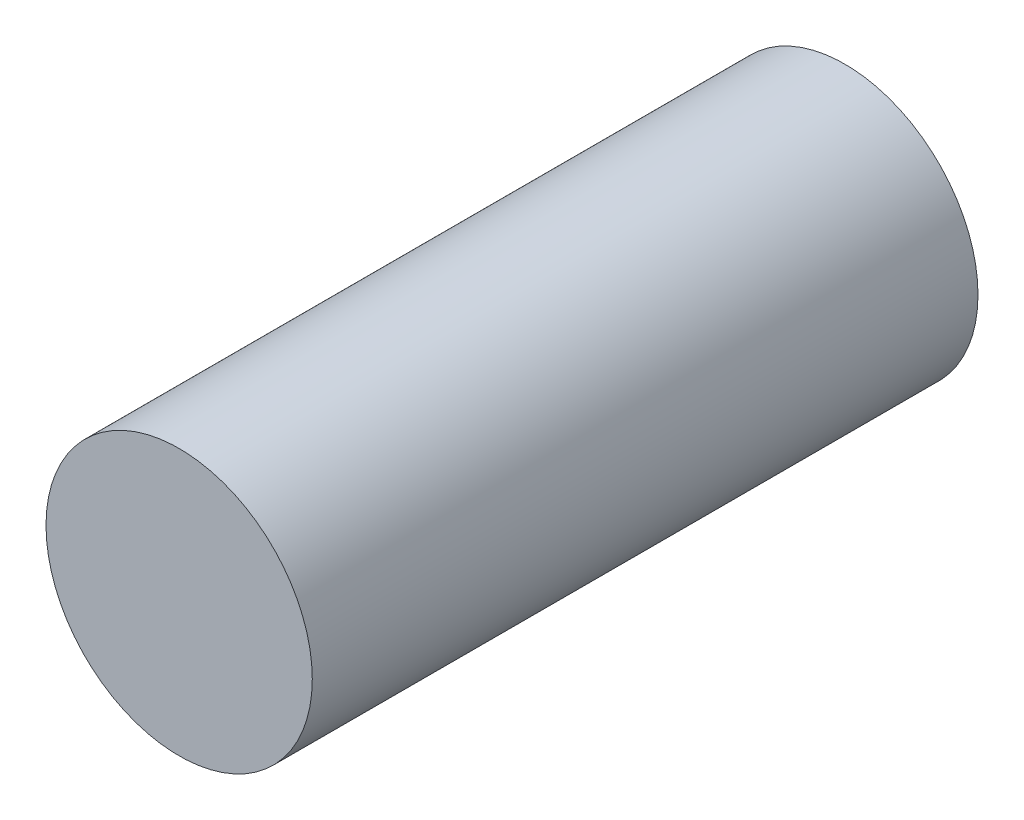
ISO-10303-21;
HEADER;
FILE_DESCRIPTION(('STEP AP214'),'2;1');
FILE_NAME('part.step','',(''),(''),'','','');
FILE_SCHEMA(('AUTOMOTIVE_DESIGN { 1 0 10303 214 1 1 1 1 }'));
ENDSEC;
DATA;
#1=APPLICATION_CONTEXT('core data for automotive mechanical design processes');
#2=APPLICATION_PROTOCOL_DEFINITION('international standard','automotive_design',2000,#1);
#3=PRODUCT_CONTEXT('',#1,'mechanical');
#4=PRODUCT('Part','Part','',(#3));
#5=PRODUCT_RELATED_PRODUCT_CATEGORY('part','',(#4));
#6=PRODUCT_DEFINITION_FORMATION('','',#4);
#7=PRODUCT_DEFINITION_CONTEXT('part definition',#1,'design');
#8=PRODUCT_DEFINITION('design','',#6,#7);
#9=PRODUCT_DEFINITION_SHAPE('','',#8);
#10=(LENGTH_UNIT() NAMED_UNIT(*) SI_UNIT(.MILLI.,.METRE.));
#11=(NAMED_UNIT(*) PLANE_ANGLE_UNIT() SI_UNIT($,.RADIAN.));
#12=(NAMED_UNIT(*) SI_UNIT($,.STERADIAN.) SOLID_ANGLE_UNIT());
#13=UNCERTAINTY_MEASURE_WITH_UNIT(LENGTH_MEASURE(1.E-05),#10,'distance_accuracy_value','');
#14=(GEOMETRIC_REPRESENTATION_CONTEXT(3) GLOBAL_UNCERTAINTY_ASSIGNED_CONTEXT((#13)) GLOBAL_UNIT_ASSIGNED_CONTEXT((#10,
#11,#12)) REPRESENTATION_CONTEXT('',''));
#15=CARTESIAN_POINT('',(0.,0.,0.));
#16=DIRECTION('',(0.,0.,1.));
#17=DIRECTION('',(1.,0.,0.));
#18=AXIS2_PLACEMENT_3D('',#15,#16,#17);
#19=CARTESIAN_POINT('',(-90.4952804002878,19.629807503028,110.001244158463));
#20=DIRECTION('',(1.71611257595984E-08,-7.22528895872218E-09,-1.));
#21=DIRECTION('',(-0.309020715712713,0.951055307151168,-1.21747927769404E-08));
#22=AXIS2_PLACEMENT_3D('',#19,#20,#21);
#23=PLANE('',#22);
#24=DIRECTION('',(-0.951055307151168,-0.309020715712713,-1.40884157708021E-08));
#25=VECTOR('',#24,1.);
#26=CARTESIAN_POINT('',(-71.954037457525,-37.433510926042,110.001244888951));
#27=LINE('',#26,#25);
#28=CARTESIAN_POINT('',(-71.954037457525,-37.433510926042,110.001244888951));
#29=VERTEX_POINT('',#28);
#30=CARTESIAN_POINT('',(-90.1217786695194,-43.3366464745212,110.001244619824));
#31=VERTEX_POINT('',#30);
#32=EDGE_CURVE('E161',#29,#31,#27,.T.);
#33=ORIENTED_EDGE('',*,*,#32,.F.);
#34=DIRECTION('',(0.309020715712713,-0.951055307151168,1.21747927769404E-08));
#35=VECTOR('',#34,1.);
#36=CARTESIAN_POINT('',(-90.4952804002878,19.629807503028,110.001244158463));
#37=LINE('',#36,#35);
#38=CARTESIAN_POINT('',(-90.4952804002878,19.629807503028,110.001244158463));
#39=VERTEX_POINT('',#38);
#40=EDGE_CURVE('E52',#39,#29,#37,.T.);
#41=ORIENTED_EDGE('',*,*,#40,.F.);
#42=DIRECTION('',(-0.951055307151168,-0.309020715712713,-1.40884157708021E-08));
#43=VECTOR('',#42,1.);
#44=CARTESIAN_POINT('',(-90.4952804002878,19.629807503028,110.001244158463));
#45=LINE('',#44,#43);
#46=CARTESIAN_POINT('',(-98.5417629016066,17.0153120443195,110.001244039267));
#47=VERTEX_POINT('',#46);
#48=EDGE_CURVE('E47',#39,#47,#45,.T.);
#49=ORIENTED_EDGE('',*,*,#48,.T.);
#50=CARTESIAN_POINT('',(5.68928788802214E-07,-2.39534117723109E-07,110.001245853295));
#51=DIRECTION('',(1.71611257595984E-08,-7.22528895872218E-09,-1.));
#52=DIRECTION('',(-0.309020715712713,0.951055307151168,-1.21747927769404E-08));
#53=AXIS2_PLACEMENT_3D('',#50,#51,#52);
#54=CIRCLE('',#53,100.);
#55=EDGE_CURVE('E11',#31,#47,#54,.T.);
#56=ORIENTED_EDGE('',*,*,#55,.F.);
#57=EDGE_LOOP('',(#33,#41,#49,#56));
#58=FACE_BOUND('',#57,.T.);
#59=ADVANCED_FACE('F33',(#58),#23,.F.);
#60=CARTESIAN_POINT('',(-90.4952804002878,19.629807503028,110.001244158463));
#61=DIRECTION('',(-0.309020715712713,0.951055307151168,-1.21747926323801E-08));
#62=DIRECTION('',(-1.71611257149262E-08,7.22528882123735E-09,1.));
#63=AXIS2_PLACEMENT_3D('',#60,#61,#62);
#64=PLANE('',#63);
#65=ORIENTED_EDGE('',*,*,#48,.F.);
#66=DIRECTION('',(1.71611257149262E-08,-7.22528882123735E-09,-1.));
#67=VECTOR('',#66,1.);
#68=CARTESIAN_POINT('',(-90.4952804002878,19.629807503028,110.001244158463));
#69=LINE('',#68,#67);
#70=CARTESIAN_POINT('',(-90.4952807435103,19.6298076475338,130.001244158463));
#71=VERTEX_POINT('',#70);
#72=EDGE_CURVE('E167',#71,#39,#69,.T.);
#73=ORIENTED_EDGE('',*,*,#72,.F.);
#74=DIRECTION('',(-0.951055307151168,-0.309020715712713,-1.40884157708021E-08));
#75=VECTOR('',#74,1.);
#76=CARTESIAN_POINT('',(-90.4952807435103,19.6298076475338,130.001244158463));
#77=LINE('',#76,#75);
#78=CARTESIAN_POINT('',(-98.5417632448291,17.0153121888253,130.001244039267));
#79=VERTEX_POINT('',#78);
#80=EDGE_CURVE('E148',#71,#79,#77,.T.);
#81=ORIENTED_EDGE('',*,*,#80,.T.);
#82=DIRECTION('',(1.71611257149262E-08,-7.22528882123735E-09,-1.));
#83=VECTOR('',#82,1.);
#84=CARTESIAN_POINT('',(-98.5417713105582,17.015315584711,600.001244039267));
#85=LINE('',#84,#83);
#86=EDGE_CURVE('E40',#47,#79,#85,.F.);
#87=ORIENTED_EDGE('',*,*,#86,.F.);
#88=EDGE_LOOP('',(#65,#73,#81,#87));
#89=FACE_BOUND('',#88,.T.);
#90=ADVANCED_FACE('F176',(#89),#64,.F.);
#91=CARTESIAN_POINT('',(-76.0844238315534,-24.7216575688041,100.001244726222));
#92=DIRECTION('',(-0.951055307151168,-0.309020715712713,-1.40884157708021E-08));
#93=DIRECTION('',(-1.71611257149262E-08,7.22528882123735E-09,1.));
#94=AXIS2_PLACEMENT_3D('',#91,#92,#93);
#95=PLANE('',#94);
#96=ORIENTED_EDGE('',*,*,#40,.T.);
#97=DIRECTION('',(-1.71611257149262E-08,7.22528882123735E-09,1.));
#98=VECTOR('',#97,1.);
#99=CARTESIAN_POINT('',(-71.954037457525,-37.433510926042,110.001244888951));
#100=LINE('',#99,#98);
#101=CARTESIAN_POINT('',(-71.9540378007475,-37.4335107815363,130.001244888951));
#102=VERTEX_POINT('',#101);
#103=EDGE_CURVE('E158',#29,#102,#100,.T.);
#104=ORIENTED_EDGE('',*,*,#103,.T.);
#105=DIRECTION('',(-0.309020715712713,0.951055307151168,-1.21747928058524E-08));
#106=VECTOR('',#105,1.);
#107=CARTESIAN_POINT('',(-90.4952807435103,19.6298076475338,130.001244158463));
#108=LINE('',#107,#106);
#109=EDGE_CURVE('E150',#102,#71,#108,.T.);
#110=ORIENTED_EDGE('',*,*,#109,.T.);
#111=ORIENTED_EDGE('',*,*,#72,.T.);
#112=EDGE_LOOP('',(#96,#104,#110,#111));
#113=FACE_BOUND('',#112,.T.);
#114=ADVANCED_FACE('F184',(#113),#95,.T.);
#115=CARTESIAN_POINT('',(-71.954037457525,-37.433510926042,110.001244888951));
#116=DIRECTION('',(0.309020715712713,-0.951055307151168,1.21747926323801E-08));
#117=DIRECTION('',(1.71611257149262E-08,-7.22528882123735E-09,-1.));
#118=AXIS2_PLACEMENT_3D('',#115,#116,#117);
#119=PLANE('',#118);
#120=DIRECTION('',(-0.951055307151168,-0.309020715712713,-1.40884157708021E-08));
#121=VECTOR('',#120,1.);
#122=CARTESIAN_POINT('',(-71.9540378007475,-37.4335107815363,130.001244888951));
#123=LINE('',#122,#121);
#124=CARTESIAN_POINT('',(-90.1217790127419,-43.3366463300154,130.001244619824));
#125=VERTEX_POINT('',#124);
#126=EDGE_CURVE('E153',#102,#125,#123,.T.);
#127=ORIENTED_EDGE('',*,*,#126,.F.);
#128=ORIENTED_EDGE('',*,*,#103,.F.);
#129=ORIENTED_EDGE('',*,*,#32,.T.);
#130=DIRECTION('',(1.71611257149262E-08,-7.22528882123735E-09,-1.));
#131=VECTOR('',#130,1.);
#132=CARTESIAN_POINT('',(-90.121787078471,-43.3366429341297,600.001244619823));
#133=LINE('',#132,#131);
#134=EDGE_CURVE('E163',#125,#31,#133,.T.);
#135=ORIENTED_EDGE('',*,*,#134,.F.);
#136=EDGE_LOOP('',(#127,#128,#129,#135));
#137=FACE_BOUND('',#136,.T.);
#138=ADVANCED_FACE('F182',(#137),#119,.F.);
#139=CARTESIAN_POINT('',(-90.4952807435103,19.6298076475338,130.001244158463));
#140=DIRECTION('',(-1.71611257685328E-08,7.22528898621915E-09,1.));
#141=DIRECTION('',(0.309020715712713,-0.951055307151168,1.21747928058524E-08));
#142=AXIS2_PLACEMENT_3D('',#139,#140,#141);
#143=PLANE('',#142);
#144=ORIENTED_EDGE('',*,*,#80,.F.);
#145=ORIENTED_EDGE('',*,*,#109,.F.);
#146=ORIENTED_EDGE('',*,*,#126,.T.);
#147=CARTESIAN_POINT('',(2.25706274503689E-07,-9.50283412983614E-08,130.001245853295));
#148=DIRECTION('',(-1.71611257685328E-08,7.22528898621915E-09,1.));
#149=DIRECTION('',(0.309020715712713,-0.951055307151168,1.21747928058524E-08));
#150=AXIS2_PLACEMENT_3D('',#147,#148,#149);
#151=CIRCLE('',#150,100.);
#152=EDGE_CURVE('E155',#79,#125,#151,.T.);
#153=ORIENTED_EDGE('',*,*,#152,.F.);
#154=EDGE_LOOP('',(#144,#145,#146,#153));
#155=FACE_BOUND('',#154,.T.);
#156=ADVANCED_FACE('F179',(#155),#143,.F.);
#157=CARTESIAN_POINT('',(0.,0.,500.));
#158=DIRECTION('',(0.,0.,-1.));
#159=DIRECTION('',(-1.,0.,0.));
#160=AXIS2_PLACEMENT_3D('',#157,#158,#159);
#161=CYLINDRICAL_SURFACE('',#160,100.);
#162=ORIENTED_EDGE('',*,*,#86,.T.);
#163=ORIENTED_EDGE('',*,*,#152,.T.);
#164=ORIENTED_EDGE('',*,*,#134,.T.);
#165=ORIENTED_EDGE('',*,*,#55,.T.);
#166=EDGE_LOOP('',(#162,#163,#164,#165));
#167=FACE_BOUND('',#166,.T.);
#168=DIRECTION('',(0.,0.,-1.));
#169=VECTOR('',#168,1.);
#170=CARTESIAN_POINT('',(-88.460583144656,46.6339493256512,500.));
#171=LINE('',#170,#169);
#172=CARTESIAN_POINT('',(-88.460583144656,46.6339493256512,10.));
#173=VERTEX_POINT('',#172);
#174=CARTESIAN_POINT('',(-88.460583144656,46.6339493256512,30.));
#175=VERTEX_POINT('',#174);
#176=EDGE_CURVE('E145',#173,#175,#171,.F.);
#177=ORIENTED_EDGE('',*,*,#176,.T.);
#178=CARTESIAN_POINT('',(0.,0.,30.));
#179=DIRECTION('',(0.,0.,1.));
#180=DIRECTION('',(0.,-1.,0.));
#181=AXIS2_PLACEMENT_3D('',#178,#179,#180);
#182=CIRCLE('',#181,100.);
#183=CARTESIAN_POINT('',(-99.1027178707565,-13.3660506743488,30.));
#184=VERTEX_POINT('',#183);
#185=EDGE_CURVE('E137',#175,#184,#182,.T.);
#186=ORIENTED_EDGE('',*,*,#185,.T.);
#187=DIRECTION('',(0.,0.,-1.));
#188=VECTOR('',#187,1.);
#189=CARTESIAN_POINT('',(-99.1027178707565,-13.3660506743488,500.));
#190=LINE('',#189,#188);
#191=CARTESIAN_POINT('',(-99.1027178707565,-13.3660506743488,10.));
#192=VERTEX_POINT('',#191);
#193=EDGE_CURVE('E143',#184,#192,#190,.T.);
#194=ORIENTED_EDGE('',*,*,#193,.T.);
#195=CARTESIAN_POINT('',(0.,0.,10.));
#196=DIRECTION('',(0.,0.,-1.));
#197=DIRECTION('',(0.,1.,0.));
#198=AXIS2_PLACEMENT_3D('',#195,#196,#197);
#199=CIRCLE('',#198,100.);
#200=EDGE_CURVE('E106',#192,#173,#199,.T.);
#201=ORIENTED_EDGE('',*,*,#200,.T.);
#202=EDGE_LOOP('',(#177,#186,#194,#201));
#203=FACE_BOUND('',#202,.T.);
#204=CARTESIAN_POINT('',(0.,0.,500.));
#205=DIRECTION('',(0.,0.,1.));
#206=DIRECTION('',(1.,0.,0.));
#207=AXIS2_PLACEMENT_3D('',#204,#205,#206);
#208=CIRCLE('',#207,100.);
#209=CARTESIAN_POINT('',(100.,0.,500.));
#210=VERTEX_POINT('',#209);
#211=EDGE_CURVE('E134',#210,#210,#208,.T.);
#212=ORIENTED_EDGE('',*,*,#211,.F.);
#213=EDGE_LOOP('',(#212));
#214=FACE_BOUND('',#213,.T.);
#215=CARTESIAN_POINT('',(0.,0.,0.));
#216=DIRECTION('',(0.,0.,1.));
#217=DIRECTION('',(1.,0.,0.));
#218=AXIS2_PLACEMENT_3D('',#215,#216,#217);
#219=CIRCLE('',#218,100.);
#220=CARTESIAN_POINT('',(100.,0.,0.));
#221=VERTEX_POINT('',#220);
#222=EDGE_CURVE('E129',#221,#221,#219,.T.);
#223=ORIENTED_EDGE('',*,*,#222,.T.);
#224=EDGE_LOOP('',(#223));
#225=FACE_BOUND('',#224,.T.);
#226=ADVANCED_FACE('F171',(#167,#203,#214,#225),#161,.T.);
#227=CARTESIAN_POINT('',(0.,0.,500.));
#228=DIRECTION('',(0.,0.,1.));
#229=DIRECTION('',(1.,0.,0.));
#230=AXIS2_PLACEMENT_3D('',#227,#228,#229);
#231=PLANE('',#230);
#232=ORIENTED_EDGE('',*,*,#211,.T.);
#233=EDGE_LOOP('',(#232));
#234=FACE_BOUND('',#233,.T.);
#235=ADVANCED_FACE('F226',(#234),#231,.T.);
#236=CARTESIAN_POINT('',(0.,0.,0.));
#237=DIRECTION('',(0.,0.,1.));
#238=DIRECTION('',(1.,0.,0.));
#239=AXIS2_PLACEMENT_3D('',#236,#237,#238);
#240=PLANE('',#239);
#241=ORIENTED_EDGE('',*,*,#222,.F.);
#242=EDGE_LOOP('',(#241));
#243=FACE_BOUND('',#242,.T.);
#244=ADVANCED_FACE('F236',(#243),#240,.F.);
#245=CARTESIAN_POINT('',(-80.,46.6339493256512,10.));
#246=DIRECTION('',(0.,0.,-1.));
#247=DIRECTION('',(0.,1.,0.));
#248=AXIS2_PLACEMENT_3D('',#245,#246,#247);
#249=PLANE('',#248);
#250=DIRECTION('',(-1.,0.,0.));
#251=VECTOR('',#250,1.);
#252=CARTESIAN_POINT('',(-80.,-13.3660506743488,10.));
#253=LINE('',#252,#251);
#254=CARTESIAN_POINT('',(-80.,-13.3660506743488,10.));
#255=VERTEX_POINT('',#254);
#256=EDGE_CURVE('E98',#255,#192,#253,.T.);
#257=ORIENTED_EDGE('',*,*,#256,.F.);
#258=DIRECTION('',(0.,-1.,0.));
#259=VECTOR('',#258,1.);
#260=CARTESIAN_POINT('',(-80.,46.6339493256512,10.));
#261=LINE('',#260,#259);
#262=CARTESIAN_POINT('',(-80.,46.6339493256512,10.));
#263=VERTEX_POINT('',#262);
#264=EDGE_CURVE('E103',#263,#255,#261,.T.);
#265=ORIENTED_EDGE('',*,*,#264,.F.);
#266=DIRECTION('',(-1.,0.,0.));
#267=VECTOR('',#266,1.);
#268=CARTESIAN_POINT('',(-80.,46.6339493256512,10.));
#269=LINE('',#268,#267);
#270=EDGE_CURVE('E127',#263,#173,#269,.T.);
#271=ORIENTED_EDGE('',*,*,#270,.T.);
#272=ORIENTED_EDGE('',*,*,#200,.F.);
#273=EDGE_LOOP('',(#257,#265,#271,#272));
#274=FACE_BOUND('',#273,.T.);
#275=ADVANCED_FACE('F100',(#274),#249,.F.);
#276=CARTESIAN_POINT('',(-80.,46.6339493256512,10.));
#277=DIRECTION('',(0.,1.,0.));
#278=DIRECTION('',(0.,0.,1.));
#279=AXIS2_PLACEMENT_3D('',#276,#277,#278);
#280=PLANE('',#279);
#281=ORIENTED_EDGE('',*,*,#270,.F.);
#282=DIRECTION('',(0.,0.,-1.));
#283=VECTOR('',#282,1.);
#284=CARTESIAN_POINT('',(-80.,46.6339493256512,10.));
#285=LINE('',#284,#283);
#286=CARTESIAN_POINT('',(-80.,46.6339493256512,30.));
#287=VERTEX_POINT('',#286);
#288=EDGE_CURVE('E110',#287,#263,#285,.T.);
#289=ORIENTED_EDGE('',*,*,#288,.F.);
#290=DIRECTION('',(-1.,0.,0.));
#291=VECTOR('',#290,1.);
#292=CARTESIAN_POINT('',(-80.,46.6339493256512,30.));
#293=LINE('',#292,#291);
#294=EDGE_CURVE('E130',#287,#175,#293,.T.);
#295=ORIENTED_EDGE('',*,*,#294,.T.);
#296=ORIENTED_EDGE('',*,*,#176,.F.);
#297=EDGE_LOOP('',(#281,#289,#295,#296));
#298=FACE_BOUND('',#297,.T.);
#299=ADVANCED_FACE('F250',(#298),#280,.F.);
#300=CARTESIAN_POINT('',(-80.,46.6339493256512,30.));
#301=DIRECTION('',(0.,0.,1.));
#302=DIRECTION('',(0.,-1.,0.));
#303=AXIS2_PLACEMENT_3D('',#300,#301,#302);
#304=PLANE('',#303);
#305=ORIENTED_EDGE('',*,*,#294,.F.);
#306=DIRECTION('',(0.,1.,0.));
#307=VECTOR('',#306,1.);
#308=CARTESIAN_POINT('',(-80.,46.6339493256512,30.));
#309=LINE('',#308,#307);
#310=CARTESIAN_POINT('',(-80.,-13.3660506743488,30.));
#311=VERTEX_POINT('',#310);
#312=EDGE_CURVE('E119',#311,#287,#309,.T.);
#313=ORIENTED_EDGE('',*,*,#312,.F.);
#314=DIRECTION('',(-1.,0.,0.));
#315=VECTOR('',#314,1.);
#316=CARTESIAN_POINT('',(-80.,-13.3660506743488,30.));
#317=LINE('',#316,#315);
#318=EDGE_CURVE('E109',#311,#184,#317,.T.);
#319=ORIENTED_EDGE('',*,*,#318,.T.);
#320=ORIENTED_EDGE('',*,*,#185,.F.);
#321=EDGE_LOOP('',(#305,#313,#319,#320));
#322=FACE_BOUND('',#321,.T.);
#323=ADVANCED_FACE('F257',(#322),#304,.F.);
#324=CARTESIAN_POINT('',(-80.,-13.3660506743488,10.));
#325=DIRECTION('',(0.,-1.,0.));
#326=DIRECTION('',(0.,0.,-1.));
#327=AXIS2_PLACEMENT_3D('',#324,#325,#326);
#328=PLANE('',#327);
#329=ORIENTED_EDGE('',*,*,#318,.F.);
#330=DIRECTION('',(0.,0.,1.));
#331=VECTOR('',#330,1.);
#332=CARTESIAN_POINT('',(-80.,-13.3660506743488,10.));
#333=LINE('',#332,#331);
#334=EDGE_CURVE('E113',#255,#311,#333,.T.);
#335=ORIENTED_EDGE('',*,*,#334,.F.);
#336=ORIENTED_EDGE('',*,*,#256,.T.);
#337=ORIENTED_EDGE('',*,*,#193,.F.);
#338=EDGE_LOOP('',(#329,#335,#336,#337));
#339=FACE_BOUND('',#338,.T.);
#340=ADVANCED_FACE('F114',(#339),#328,.F.);
#341=CARTESIAN_POINT('',(-80.,0.,0.));
#342=DIRECTION('',(-1.,0.,0.));
#343=DIRECTION('',(0.,0.,1.));
#344=AXIS2_PLACEMENT_3D('',#341,#342,#343);
#345=PLANE('',#344);
#346=ORIENTED_EDGE('',*,*,#264,.T.);
#347=ORIENTED_EDGE('',*,*,#334,.T.);
#348=ORIENTED_EDGE('',*,*,#312,.T.);
#349=ORIENTED_EDGE('',*,*,#288,.T.);
#350=EDGE_LOOP('',(#346,#347,#348,#349));
#351=FACE_BOUND('',#350,.T.);
#352=ADVANCED_FACE('F121',(#351),#345,.T.);
#353=CLOSED_SHELL('',(#59,#90,#114,#138,#156,#226,#235,#244,#275,#299,#323,#340,#352));
#354=MANIFOLD_SOLID_BREP('B2',#353);
#355=ADVANCED_BREP_SHAPE_REPRESENTATION('',(#18,#354),#14);
#356=SHAPE_DEFINITION_REPRESENTATION(#9,#355);
ENDSEC;
END-ISO-10303-21;
